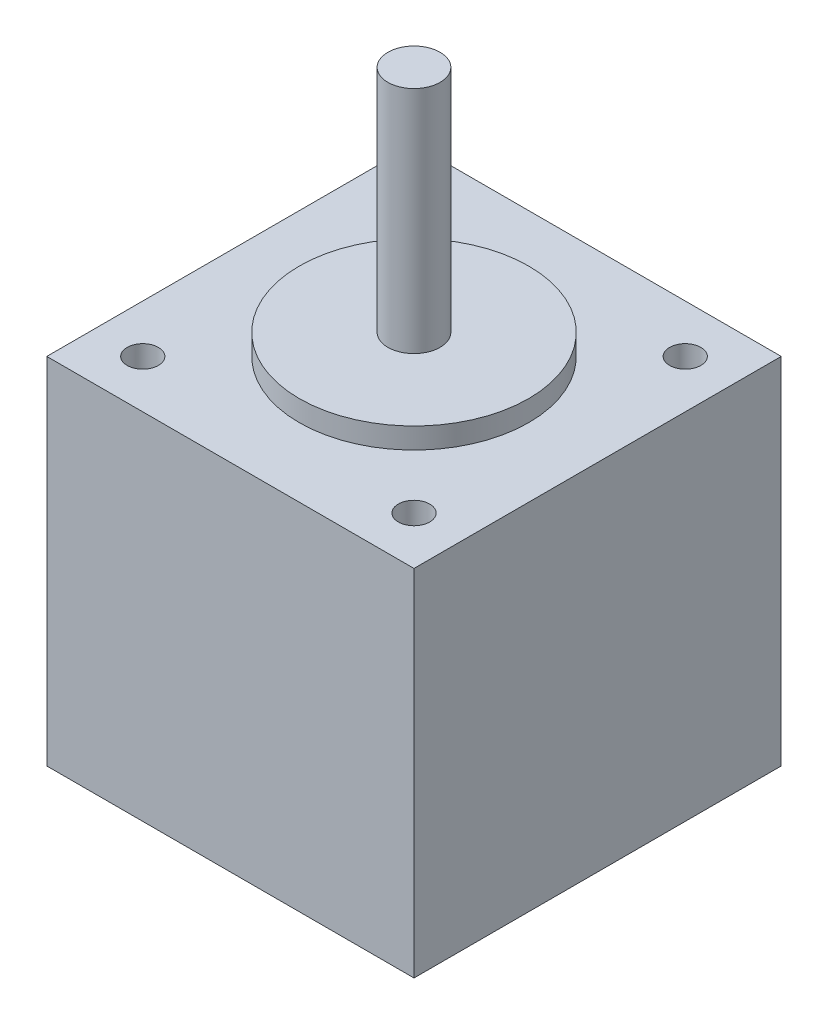
ISO-10303-21;
HEADER;
FILE_DESCRIPTION(('STEP AP214'),'2;1');
FILE_NAME('part.step','',(''),(''),'','','');
FILE_SCHEMA(('AUTOMOTIVE_DESIGN { 1 0 10303 214 1 1 1 1 }'));
ENDSEC;
DATA;
#1=APPLICATION_CONTEXT('core data for automotive mechanical design processes');
#2=APPLICATION_PROTOCOL_DEFINITION('international standard','automotive_design',2000,#1);
#3=PRODUCT_CONTEXT('',#1,'mechanical');
#4=PRODUCT('Part','Part','',(#3));
#5=PRODUCT_RELATED_PRODUCT_CATEGORY('part','',(#4));
#6=PRODUCT_DEFINITION_FORMATION('','',#4);
#7=PRODUCT_DEFINITION_CONTEXT('part definition',#1,'design');
#8=PRODUCT_DEFINITION('design','',#6,#7);
#9=PRODUCT_DEFINITION_SHAPE('','',#8);
#10=(LENGTH_UNIT() NAMED_UNIT(*) SI_UNIT(.MILLI.,.METRE.));
#11=(NAMED_UNIT(*) PLANE_ANGLE_UNIT() SI_UNIT($,.RADIAN.));
#12=(NAMED_UNIT(*) SI_UNIT($,.STERADIAN.) SOLID_ANGLE_UNIT());
#13=UNCERTAINTY_MEASURE_WITH_UNIT(LENGTH_MEASURE(1.E-05),#10,'distance_accuracy_value','');
#14=(GEOMETRIC_REPRESENTATION_CONTEXT(3) GLOBAL_UNCERTAINTY_ASSIGNED_CONTEXT((#13)) GLOBAL_UNIT_ASSIGNED_CONTEXT((#10,
#11,#12)) REPRESENTATION_CONTEXT('',''));
#15=CARTESIAN_POINT('',(0.,0.,0.));
#16=DIRECTION('',(0.,0.,1.));
#17=DIRECTION('',(1.,0.,0.));
#18=AXIS2_PLACEMENT_3D('',#15,#16,#17);
#19=CARTESIAN_POINT('',(17.6000000000001,34.,17.5999999999999));
#20=DIRECTION('',(-1.,0.,0.));
#21=DIRECTION('',(0.,0.,1.));
#22=AXIS2_PLACEMENT_3D('',#19,#20,#21);
#23=PLANE('',#22);
#24=DIRECTION('',(0.,0.,-1.));
#25=VECTOR('',#24,1.);
#26=CARTESIAN_POINT('',(17.6000000000001,0.,17.5999999999999));
#27=LINE('',#26,#25);
#28=CARTESIAN_POINT('',(17.6000000000001,0.,17.5999999999999));
#29=VERTEX_POINT('',#28);
#30=CARTESIAN_POINT('',(17.6000000000001,0.,-17.6000000000001));
#31=VERTEX_POINT('',#30);
#32=EDGE_CURVE('E104',#29,#31,#27,.T.);
#33=ORIENTED_EDGE('',*,*,#32,.T.);
#34=DIRECTION('',(0.,-1.,0.));
#35=VECTOR('',#34,1.);
#36=CARTESIAN_POINT('',(17.6000000000001,34.,-17.6000000000001));
#37=LINE('',#36,#35);
#38=CARTESIAN_POINT('',(17.6000000000001,34.,-17.6000000000001));
#39=VERTEX_POINT('',#38);
#40=EDGE_CURVE('E95',#39,#31,#37,.T.);
#41=ORIENTED_EDGE('',*,*,#40,.F.);
#42=DIRECTION('',(0.,0.,-1.));
#43=VECTOR('',#42,1.);
#44=CARTESIAN_POINT('',(17.6000000000001,34.,17.5999999999999));
#45=LINE('',#44,#43);
#46=CARTESIAN_POINT('',(17.6000000000001,34.,17.5999999999999));
#47=VERTEX_POINT('',#46);
#48=EDGE_CURVE('E89',#47,#39,#45,.T.);
#49=ORIENTED_EDGE('',*,*,#48,.F.);
#50=DIRECTION('',(0.,-1.,0.));
#51=VECTOR('',#50,1.);
#52=CARTESIAN_POINT('',(17.6000000000001,34.,17.5999999999999));
#53=LINE('',#52,#51);
#54=EDGE_CURVE('E100',#47,#29,#53,.T.);
#55=ORIENTED_EDGE('',*,*,#54,.T.);
#56=EDGE_LOOP('',(#33,#41,#49,#55));
#57=FACE_BOUND('',#56,.T.);
#58=ADVANCED_FACE('F36',(#57),#23,.F.);
#59=CARTESIAN_POINT('',(-17.5999999999999,34.,-17.6000000000001));
#60=DIRECTION('',(0.,0.,1.));
#61=DIRECTION('',(1.,0.,0.));
#62=AXIS2_PLACEMENT_3D('',#59,#60,#61);
#63=PLANE('',#62);
#64=DIRECTION('',(-1.,0.,0.));
#65=VECTOR('',#64,1.);
#66=CARTESIAN_POINT('',(-17.5999999999999,0.,-17.6000000000001));
#67=LINE('',#66,#65);
#68=CARTESIAN_POINT('',(-17.5999999999999,0.,-17.6000000000001));
#69=VERTEX_POINT('',#68);
#70=EDGE_CURVE('E94',#31,#69,#67,.T.);
#71=ORIENTED_EDGE('',*,*,#70,.T.);
#72=DIRECTION('',(0.,-1.,0.));
#73=VECTOR('',#72,1.);
#74=CARTESIAN_POINT('',(-17.5999999999999,34.,-17.6000000000001));
#75=LINE('',#74,#73);
#76=CARTESIAN_POINT('',(-17.5999999999999,34.,-17.6000000000001));
#77=VERTEX_POINT('',#76);
#78=EDGE_CURVE('E92',#77,#69,#75,.T.);
#79=ORIENTED_EDGE('',*,*,#78,.F.);
#80=DIRECTION('',(-1.,0.,0.));
#81=VECTOR('',#80,1.);
#82=CARTESIAN_POINT('',(-17.5999999999999,34.,-17.6000000000001));
#83=LINE('',#82,#81);
#84=EDGE_CURVE('E84',#39,#77,#83,.T.);
#85=ORIENTED_EDGE('',*,*,#84,.F.);
#86=ORIENTED_EDGE('',*,*,#40,.T.);
#87=EDGE_LOOP('',(#71,#79,#85,#86));
#88=FACE_BOUND('',#87,.T.);
#89=ADVANCED_FACE('F93',(#88),#63,.F.);
#90=CARTESIAN_POINT('',(-17.5999999999999,34.,17.5999999999999));
#91=DIRECTION('',(1.,0.,0.));
#92=DIRECTION('',(0.,0.,-1.));
#93=AXIS2_PLACEMENT_3D('',#90,#91,#92);
#94=PLANE('',#93);
#95=DIRECTION('',(0.,0.,1.));
#96=VECTOR('',#95,1.);
#97=CARTESIAN_POINT('',(-17.5999999999999,0.,17.5999999999999));
#98=LINE('',#97,#96);
#99=CARTESIAN_POINT('',(-17.5999999999999,0.,17.5999999999999));
#100=VERTEX_POINT('',#99);
#101=EDGE_CURVE('E70',#69,#100,#98,.T.);
#102=ORIENTED_EDGE('',*,*,#101,.T.);
#103=DIRECTION('',(0.,-1.,0.));
#104=VECTOR('',#103,1.);
#105=CARTESIAN_POINT('',(-17.5999999999999,34.,17.5999999999999));
#106=LINE('',#105,#104);
#107=CARTESIAN_POINT('',(-17.5999999999999,34.,17.5999999999999));
#108=VERTEX_POINT('',#107);
#109=EDGE_CURVE('E96',#108,#100,#106,.T.);
#110=ORIENTED_EDGE('',*,*,#109,.F.);
#111=DIRECTION('',(0.,0.,1.));
#112=VECTOR('',#111,1.);
#113=CARTESIAN_POINT('',(-17.5999999999999,34.,17.5999999999999));
#114=LINE('',#113,#112);
#115=EDGE_CURVE('E87',#77,#108,#114,.T.);
#116=ORIENTED_EDGE('',*,*,#115,.F.);
#117=ORIENTED_EDGE('',*,*,#78,.T.);
#118=EDGE_LOOP('',(#102,#110,#116,#117));
#119=FACE_BOUND('',#118,.T.);
#120=ADVANCED_FACE('F98',(#119),#94,.F.);
#121=CARTESIAN_POINT('',(-17.5999999999999,34.,17.5999999999999));
#122=DIRECTION('',(0.,0.,-1.));
#123=DIRECTION('',(-1.,0.,0.));
#124=AXIS2_PLACEMENT_3D('',#121,#122,#123);
#125=PLANE('',#124);
#126=DIRECTION('',(1.,0.,0.));
#127=VECTOR('',#126,1.);
#128=CARTESIAN_POINT('',(-17.5999999999999,0.,17.5999999999999));
#129=LINE('',#128,#127);
#130=EDGE_CURVE('E76',#100,#29,#129,.T.);
#131=ORIENTED_EDGE('',*,*,#130,.T.);
#132=ORIENTED_EDGE('',*,*,#54,.F.);
#133=DIRECTION('',(1.,0.,0.));
#134=VECTOR('',#133,1.);
#135=CARTESIAN_POINT('',(-17.5999999999999,34.,17.5999999999999));
#136=LINE('',#135,#134);
#137=EDGE_CURVE('E53',#108,#47,#136,.T.);
#138=ORIENTED_EDGE('',*,*,#137,.F.);
#139=ORIENTED_EDGE('',*,*,#109,.T.);
#140=EDGE_LOOP('',(#131,#132,#138,#139));
#141=FACE_BOUND('',#140,.T.);
#142=ADVANCED_FACE('F120',(#141),#125,.F.);
#143=CARTESIAN_POINT('',(0.,34.,0.));
#144=DIRECTION('',(0.,-1.,0.));
#145=DIRECTION('',(0.,0.,-1.));
#146=AXIS2_PLACEMENT_3D('',#143,#144,#145);
#147=PLANE('',#146);
#148=CARTESIAN_POINT('',(0.,34.,0.));
#149=DIRECTION('',(0.,-1.,0.));
#150=DIRECTION('',(0.,0.,-1.));
#151=AXIS2_PLACEMENT_3D('',#148,#149,#150);
#152=CIRCLE('',#151,11.);
#153=CARTESIAN_POINT('',(0.,34.,-11.));
#154=VERTEX_POINT('',#153);
#155=EDGE_CURVE('E39',#154,#154,#152,.F.);
#156=ORIENTED_EDGE('',*,*,#155,.F.);
#157=EDGE_LOOP('',(#156));
#158=FACE_BOUND('',#157,.T.);
#159=CARTESIAN_POINT('',(-13.,34.,13.));
#160=DIRECTION('',(0.,-1.,0.));
#161=DIRECTION('',(0.,0.,-1.));
#162=AXIS2_PLACEMENT_3D('',#159,#160,#161);
#163=CIRCLE('',#162,1.5);
#164=CARTESIAN_POINT('',(-13.,34.,11.5));
#165=VERTEX_POINT('',#164);
#166=EDGE_CURVE('E125',#165,#165,#163,.T.);
#167=ORIENTED_EDGE('',*,*,#166,.T.);
#168=EDGE_LOOP('',(#167));
#169=FACE_BOUND('',#168,.T.);
#170=CARTESIAN_POINT('',(13.,34.,13.));
#171=DIRECTION('',(0.,-1.,0.));
#172=DIRECTION('',(0.,0.,-1.));
#173=AXIS2_PLACEMENT_3D('',#170,#171,#172);
#174=CIRCLE('',#173,1.5);
#175=CARTESIAN_POINT('',(13.,34.,11.5));
#176=VERTEX_POINT('',#175);
#177=EDGE_CURVE('E129',#176,#176,#174,.T.);
#178=ORIENTED_EDGE('',*,*,#177,.T.);
#179=EDGE_LOOP('',(#178));
#180=FACE_BOUND('',#179,.T.);
#181=CARTESIAN_POINT('',(-13.,34.,-13.));
#182=DIRECTION('',(0.,1.,0.));
#183=DIRECTION('',(0.,0.,1.));
#184=AXIS2_PLACEMENT_3D('',#181,#182,#183);
#185=CIRCLE('',#184,1.5);
#186=CARTESIAN_POINT('',(-13.,34.,-11.5));
#187=VERTEX_POINT('',#186);
#188=EDGE_CURVE('E133',#187,#187,#185,.T.);
#189=ORIENTED_EDGE('',*,*,#188,.F.);
#190=EDGE_LOOP('',(#189));
#191=FACE_BOUND('',#190,.T.);
#192=CARTESIAN_POINT('',(13.,34.,-13.));
#193=DIRECTION('',(0.,1.,0.));
#194=DIRECTION('',(0.,0.,1.));
#195=AXIS2_PLACEMENT_3D('',#192,#193,#194);
#196=CIRCLE('',#195,1.5);
#197=CARTESIAN_POINT('',(13.,34.,-11.5));
#198=VERTEX_POINT('',#197);
#199=EDGE_CURVE('E136',#198,#198,#196,.T.);
#200=ORIENTED_EDGE('',*,*,#199,.F.);
#201=EDGE_LOOP('',(#200));
#202=FACE_BOUND('',#201,.T.);
#203=ORIENTED_EDGE('',*,*,#48,.T.);
#204=ORIENTED_EDGE('',*,*,#84,.T.);
#205=ORIENTED_EDGE('',*,*,#115,.T.);
#206=ORIENTED_EDGE('',*,*,#137,.T.);
#207=EDGE_LOOP('',(#203,#204,#205,#206));
#208=FACE_BOUND('',#207,.T.);
#209=ADVANCED_FACE('F85',(#158,#169,#180,#191,#202,#208),#147,.F.);
#210=CARTESIAN_POINT('',(0.,0.,0.));
#211=DIRECTION('',(0.,-1.,0.));
#212=DIRECTION('',(0.,0.,-1.));
#213=AXIS2_PLACEMENT_3D('',#210,#211,#212);
#214=PLANE('',#213);
#215=ORIENTED_EDGE('',*,*,#32,.F.);
#216=ORIENTED_EDGE('',*,*,#130,.F.);
#217=ORIENTED_EDGE('',*,*,#101,.F.);
#218=ORIENTED_EDGE('',*,*,#70,.F.);
#219=EDGE_LOOP('',(#215,#216,#217,#218));
#220=FACE_BOUND('',#219,.T.);
#221=ADVANCED_FACE('F119',(#220),#214,.T.);
#222=CARTESIAN_POINT('',(13.,29.5,-13.));
#223=DIRECTION('',(0.,1.,0.));
#224=DIRECTION('',(0.,0.,1.));
#225=AXIS2_PLACEMENT_3D('',#222,#223,#224);
#226=CYLINDRICAL_SURFACE('',#225,1.5);
#227=CARTESIAN_POINT('',(13.,29.5,-13.));
#228=DIRECTION('',(0.,1.,0.));
#229=DIRECTION('',(0.,0.,1.));
#230=AXIS2_PLACEMENT_3D('',#227,#228,#229);
#231=CIRCLE('',#230,1.5);
#232=CARTESIAN_POINT('',(13.,29.5,-11.5));
#233=VERTEX_POINT('',#232);
#234=EDGE_CURVE('E138',#233,#233,#231,.T.);
#235=ORIENTED_EDGE('',*,*,#234,.F.);
#236=EDGE_LOOP('',(#235));
#237=FACE_BOUND('',#236,.T.);
#238=ORIENTED_EDGE('',*,*,#199,.T.);
#239=EDGE_LOOP('',(#238));
#240=FACE_BOUND('',#239,.T.);
#241=ADVANCED_FACE('F192',(#237,#240),#226,.F.);
#242=CARTESIAN_POINT('',(13.,29.5,-13.));
#243=DIRECTION('',(0.,1.,0.));
#244=DIRECTION('',(0.,0.,1.));
#245=AXIS2_PLACEMENT_3D('',#242,#243,#244);
#246=PLANE('',#245);
#247=ORIENTED_EDGE('',*,*,#234,.T.);
#248=EDGE_LOOP('',(#247));
#249=FACE_BOUND('',#248,.T.);
#250=ADVANCED_FACE('F197',(#249),#246,.T.);
#251=CARTESIAN_POINT('',(-13.,29.5,-13.));
#252=DIRECTION('',(0.,1.,0.));
#253=DIRECTION('',(0.,0.,1.));
#254=AXIS2_PLACEMENT_3D('',#251,#252,#253);
#255=CYLINDRICAL_SURFACE('',#254,1.5);
#256=CARTESIAN_POINT('',(-13.,29.5,-13.));
#257=DIRECTION('',(0.,1.,0.));
#258=DIRECTION('',(0.,0.,1.));
#259=AXIS2_PLACEMENT_3D('',#256,#257,#258);
#260=CIRCLE('',#259,1.5);
#261=CARTESIAN_POINT('',(-13.,29.5,-11.5));
#262=VERTEX_POINT('',#261);
#263=EDGE_CURVE('E107',#262,#262,#260,.T.);
#264=ORIENTED_EDGE('',*,*,#263,.F.);
#265=EDGE_LOOP('',(#264));
#266=FACE_BOUND('',#265,.T.);
#267=ORIENTED_EDGE('',*,*,#188,.T.);
#268=EDGE_LOOP('',(#267));
#269=FACE_BOUND('',#268,.T.);
#270=ADVANCED_FACE('F283',(#266,#269),#255,.F.);
#271=CARTESIAN_POINT('',(-13.,29.5,-13.));
#272=DIRECTION('',(0.,1.,0.));
#273=DIRECTION('',(0.,0.,1.));
#274=AXIS2_PLACEMENT_3D('',#271,#272,#273);
#275=PLANE('',#274);
#276=ORIENTED_EDGE('',*,*,#263,.T.);
#277=EDGE_LOOP('',(#276));
#278=FACE_BOUND('',#277,.T.);
#279=ADVANCED_FACE('F274',(#278),#275,.T.);
#280=CARTESIAN_POINT('',(13.,29.5,13.));
#281=DIRECTION('',(0.,1.,0.));
#282=DIRECTION('',(0.,0.,1.));
#283=AXIS2_PLACEMENT_3D('',#280,#281,#282);
#284=CYLINDRICAL_SURFACE('',#283,1.5);
#285=CARTESIAN_POINT('',(13.,29.5,13.));
#286=DIRECTION('',(0.,-1.,0.));
#287=DIRECTION('',(0.,0.,-1.));
#288=AXIS2_PLACEMENT_3D('',#285,#286,#287);
#289=CIRCLE('',#288,1.5);
#290=CARTESIAN_POINT('',(13.,29.5,11.5));
#291=VERTEX_POINT('',#290);
#292=EDGE_CURVE('E150',#291,#291,#289,.T.);
#293=ORIENTED_EDGE('',*,*,#292,.T.);
#294=EDGE_LOOP('',(#293));
#295=FACE_BOUND('',#294,.T.);
#296=ORIENTED_EDGE('',*,*,#177,.F.);
#297=EDGE_LOOP('',(#296));
#298=FACE_BOUND('',#297,.T.);
#299=ADVANCED_FACE('F265',(#295,#298),#284,.F.);
#300=CARTESIAN_POINT('',(13.,29.5,13.));
#301=DIRECTION('',(0.,1.,0.));
#302=DIRECTION('',(0.,0.,-1.));
#303=AXIS2_PLACEMENT_3D('',#300,#301,#302);
#304=PLANE('',#303);
#305=ORIENTED_EDGE('',*,*,#292,.F.);
#306=EDGE_LOOP('',(#305));
#307=FACE_BOUND('',#306,.T.);
#308=ADVANCED_FACE('F256',(#307),#304,.T.);
#309=CARTESIAN_POINT('',(-13.,29.5,13.));
#310=DIRECTION('',(0.,1.,0.));
#311=DIRECTION('',(0.,0.,1.));
#312=AXIS2_PLACEMENT_3D('',#309,#310,#311);
#313=CYLINDRICAL_SURFACE('',#312,1.5);
#314=CARTESIAN_POINT('',(-13.,29.5,13.));
#315=DIRECTION('',(0.,-1.,0.));
#316=DIRECTION('',(0.,0.,-1.));
#317=AXIS2_PLACEMENT_3D('',#314,#315,#316);
#318=CIRCLE('',#317,1.5);
#319=CARTESIAN_POINT('',(-13.,29.5,11.5));
#320=VERTEX_POINT('',#319);
#321=EDGE_CURVE('E139',#320,#320,#318,.T.);
#322=ORIENTED_EDGE('',*,*,#321,.T.);
#323=EDGE_LOOP('',(#322));
#324=FACE_BOUND('',#323,.T.);
#325=ORIENTED_EDGE('',*,*,#166,.F.);
#326=EDGE_LOOP('',(#325));
#327=FACE_BOUND('',#326,.T.);
#328=ADVANCED_FACE('F181',(#324,#327),#313,.F.);
#329=CARTESIAN_POINT('',(-13.,29.5,13.));
#330=DIRECTION('',(0.,1.,0.));
#331=DIRECTION('',(0.,0.,-1.));
#332=AXIS2_PLACEMENT_3D('',#329,#330,#331);
#333=PLANE('',#332);
#334=ORIENTED_EDGE('',*,*,#321,.F.);
#335=EDGE_LOOP('',(#334));
#336=FACE_BOUND('',#335,.T.);
#337=ADVANCED_FACE('F176',(#336),#333,.T.);
#338=CARTESIAN_POINT('',(0.,36.,0.));
#339=DIRECTION('',(0.,-1.,0.));
#340=DIRECTION('',(0.,0.,-1.));
#341=AXIS2_PLACEMENT_3D('',#338,#339,#340);
#342=CYLINDRICAL_SURFACE('',#341,11.);
#343=CARTESIAN_POINT('',(0.,36.,0.));
#344=DIRECTION('',(0.,1.,0.));
#345=DIRECTION('',(0.,0.,1.));
#346=AXIS2_PLACEMENT_3D('',#343,#344,#345);
#347=CIRCLE('',#346,11.);
#348=CARTESIAN_POINT('',(0.,36.,11.));
#349=VERTEX_POINT('',#348);
#350=EDGE_CURVE('E151',#349,#349,#347,.T.);
#351=ORIENTED_EDGE('',*,*,#350,.F.);
#352=EDGE_LOOP('',(#351));
#353=FACE_BOUND('',#352,.T.);
#354=ORIENTED_EDGE('',*,*,#155,.T.);
#355=EDGE_LOOP('',(#354));
#356=FACE_BOUND('',#355,.T.);
#357=ADVANCED_FACE('F115',(#353,#356),#342,.T.);
#358=CARTESIAN_POINT('',(0.,36.,0.));
#359=DIRECTION('',(0.,1.,0.));
#360=DIRECTION('',(0.,0.,1.));
#361=AXIS2_PLACEMENT_3D('',#358,#359,#360);
#362=PLANE('',#361);
#363=CARTESIAN_POINT('',(0.,36.,0.));
#364=DIRECTION('',(0.,1.,0.));
#365=DIRECTION('',(0.,0.,1.));
#366=AXIS2_PLACEMENT_3D('',#363,#364,#365);
#367=CIRCLE('',#366,2.5);
#368=CARTESIAN_POINT('',(0.,36.,2.5));
#369=VERTEX_POINT('',#368);
#370=EDGE_CURVE('E11',#369,#369,#367,.T.);
#371=ORIENTED_EDGE('',*,*,#370,.F.);
#372=EDGE_LOOP('',(#371));
#373=FACE_BOUND('',#372,.T.);
#374=ORIENTED_EDGE('',*,*,#350,.T.);
#375=EDGE_LOOP('',(#374));
#376=FACE_BOUND('',#375,.T.);
#377=ADVANCED_FACE('F166',(#373,#376),#362,.T.);
#378=CARTESIAN_POINT('',(0.,58.,0.));
#379=DIRECTION('',(0.,-1.,0.));
#380=DIRECTION('',(0.,0.,-1.));
#381=AXIS2_PLACEMENT_3D('',#378,#379,#380);
#382=CYLINDRICAL_SURFACE('',#381,2.5);
#383=CARTESIAN_POINT('',(0.,58.,0.));
#384=DIRECTION('',(0.,1.,0.));
#385=DIRECTION('',(0.,0.,1.));
#386=AXIS2_PLACEMENT_3D('',#383,#384,#385);
#387=CIRCLE('',#386,2.5);
#388=CARTESIAN_POINT('',(0.,58.,2.5));
#389=VERTEX_POINT('',#388);
#390=EDGE_CURVE('E156',#389,#389,#387,.T.);
#391=ORIENTED_EDGE('',*,*,#390,.F.);
#392=EDGE_LOOP('',(#391));
#393=FACE_BOUND('',#392,.T.);
#394=ORIENTED_EDGE('',*,*,#370,.T.);
#395=EDGE_LOOP('',(#394));
#396=FACE_BOUND('',#395,.T.);
#397=ADVANCED_FACE('F163',(#393,#396),#382,.T.);
#398=CARTESIAN_POINT('',(0.,58.,0.));
#399=DIRECTION('',(0.,1.,0.));
#400=DIRECTION('',(0.,0.,1.));
#401=AXIS2_PLACEMENT_3D('',#398,#399,#400);
#402=PLANE('',#401);
#403=ORIENTED_EDGE('',*,*,#390,.T.);
#404=EDGE_LOOP('',(#403));
#405=FACE_BOUND('',#404,.T.);
#406=ADVANCED_FACE('F161',(#405),#402,.T.);
#407=CLOSED_SHELL('',(#58,#89,#120,#142,#209,#221,#241,#250,#270,#279,#299,#308,#328,#337,#357,
#377,#397,#406));
#408=MANIFOLD_SOLID_BREP('B2',#407);
#409=ADVANCED_BREP_SHAPE_REPRESENTATION('',(#18,#408),#14);
#410=SHAPE_DEFINITION_REPRESENTATION(#9,#409);
ENDSEC;
END-ISO-10303-21;
